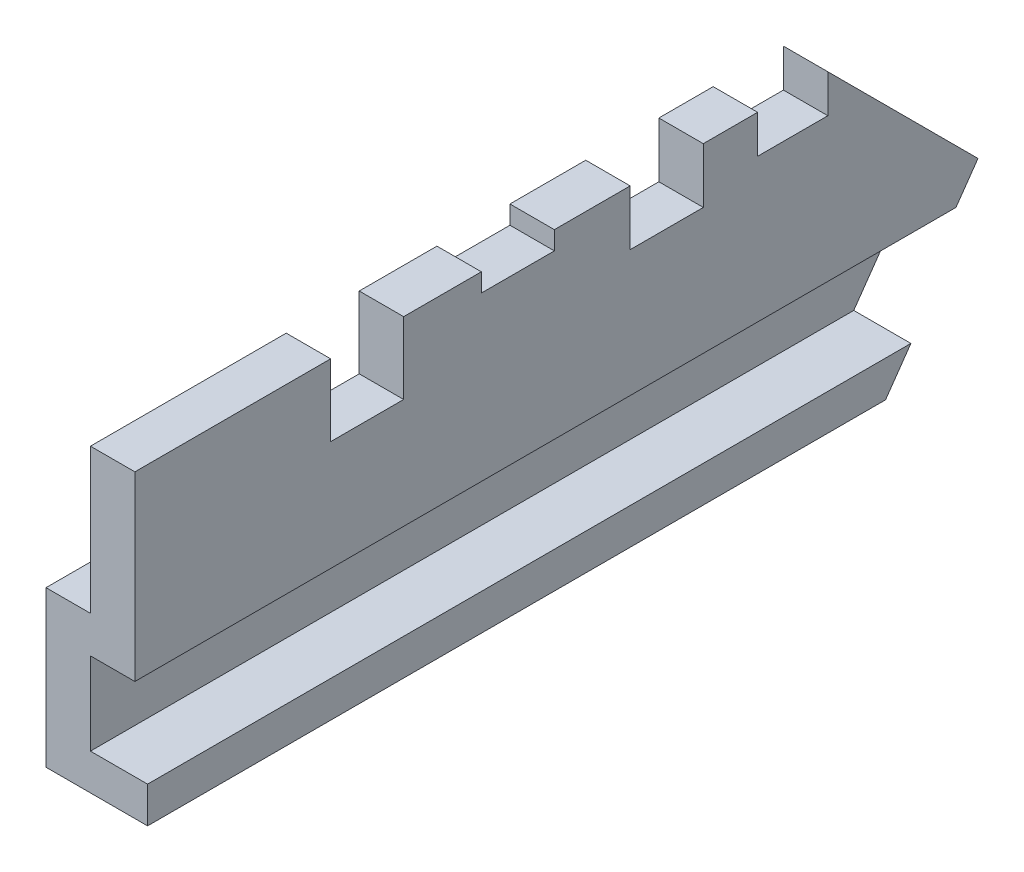
ISO-10303-21;
HEADER;
FILE_DESCRIPTION(('STEP AP214'),'2;1');
FILE_NAME('part.step','',(''),(''),'','','');
FILE_SCHEMA(('AUTOMOTIVE_DESIGN { 1 0 10303 214 1 1 1 1 }'));
ENDSEC;
DATA;
#1=APPLICATION_CONTEXT('core data for automotive mechanical design processes');
#2=APPLICATION_PROTOCOL_DEFINITION('international standard','automotive_design',2000,#1);
#3=PRODUCT_CONTEXT('',#1,'mechanical');
#4=PRODUCT('Part','Part','',(#3));
#5=PRODUCT_RELATED_PRODUCT_CATEGORY('part','',(#4));
#6=PRODUCT_DEFINITION_FORMATION('','',#4);
#7=PRODUCT_DEFINITION_CONTEXT('part definition',#1,'design');
#8=PRODUCT_DEFINITION('design','',#6,#7);
#9=PRODUCT_DEFINITION_SHAPE('','',#8);
#10=(LENGTH_UNIT() NAMED_UNIT(*) SI_UNIT(.MILLI.,.METRE.));
#11=(NAMED_UNIT(*) PLANE_ANGLE_UNIT() SI_UNIT($,.RADIAN.));
#12=(NAMED_UNIT(*) SI_UNIT($,.STERADIAN.) SOLID_ANGLE_UNIT());
#13=UNCERTAINTY_MEASURE_WITH_UNIT(LENGTH_MEASURE(1.E-05),#10,'distance_accuracy_value','');
#14=(GEOMETRIC_REPRESENTATION_CONTEXT(3) GLOBAL_UNCERTAINTY_ASSIGNED_CONTEXT((#13)) GLOBAL_UNIT_ASSIGNED_CONTEXT((#10,
#11,#12)) REPRESENTATION_CONTEXT('',''));
#15=CARTESIAN_POINT('',(0.,0.,0.));
#16=DIRECTION('',(0.,0.,1.));
#17=DIRECTION('',(1.,0.,0.));
#18=AXIS2_PLACEMENT_3D('',#15,#16,#17);
#19=CARTESIAN_POINT('',(0.,2.28,13.28));
#20=DIRECTION('',(0.,-1.,0.));
#21=DIRECTION('',(1.,0.,0.));
#22=AXIS2_PLACEMENT_3D('',#19,#20,#21);
#23=PLANE('',#22);
#24=DIRECTION('',(1.,0.,0.));
#25=VECTOR('',#24,1.);
#26=CARTESIAN_POINT('',(0.,2.28,3.47118438133992));
#27=LINE('',#26,#25);
#28=CARTESIAN_POINT('',(0.,2.28,3.47118438133992));
#29=VERTEX_POINT('',#28);
#30=CARTESIAN_POINT('',(0.7,2.28,3.47118438133992));
#31=VERTEX_POINT('',#30);
#32=EDGE_CURVE('E214',#29,#31,#27,.T.);
#33=ORIENTED_EDGE('',*,*,#32,.F.);
#34=DIRECTION('',(0.,0.,-1.));
#35=VECTOR('',#34,1.);
#36=CARTESIAN_POINT('',(0.,2.28,13.28));
#37=LINE('',#36,#35);
#38=CARTESIAN_POINT('',(0.,2.28,4.3267865277607));
#39=VERTEX_POINT('',#38);
#40=EDGE_CURVE('E251',#39,#29,#37,.T.);
#41=ORIENTED_EDGE('',*,*,#40,.F.);
#42=DIRECTION('',(1.,0.,0.));
#43=VECTOR('',#42,1.);
#44=CARTESIAN_POINT('',(0.,2.28,4.32678652776069));
#45=LINE('',#44,#43);
#46=CARTESIAN_POINT('',(0.7,2.28,4.32678652776069));
#47=VERTEX_POINT('',#46);
#48=EDGE_CURVE('E54',#39,#47,#45,.T.);
#49=ORIENTED_EDGE('',*,*,#48,.T.);
#50=DIRECTION('',(0.,0.,-1.));
#51=VECTOR('',#50,1.);
#52=CARTESIAN_POINT('',(0.7,2.28,13.28));
#53=LINE('',#52,#51);
#54=EDGE_CURVE('E234',#47,#31,#53,.T.);
#55=ORIENTED_EDGE('',*,*,#54,.T.);
#56=EDGE_LOOP('',(#33,#41,#49,#55));
#57=FACE_BOUND('',#56,.T.);
#58=ADVANCED_FACE('F37',(#57),#23,.F.);
#59=DIRECTION('',(1.,0.,0.));
#60=VECTOR('',#59,1.);
#61=CARTESIAN_POINT('',(0.,2.28,5.47861114558183));
#62=LINE('',#61,#60);
#63=CARTESIAN_POINT('',(0.,2.28,5.47861114558183));
#64=VERTEX_POINT('',#63);
#65=CARTESIAN_POINT('',(0.7,2.28,5.47861114558183));
#66=VERTEX_POINT('',#65);
#67=EDGE_CURVE('E587',#64,#66,#62,.T.);
#68=ORIENTED_EDGE('',*,*,#67,.F.);
#69=CARTESIAN_POINT('',(0.,2.28,6.67250000000002));
#70=VERTEX_POINT('',#69);
#71=EDGE_CURVE('E269',#70,#64,#37,.T.);
#72=ORIENTED_EDGE('',*,*,#71,.F.);
#73=DIRECTION('',(-1.,0.,0.));
#74=VECTOR('',#73,1.);
#75=CARTESIAN_POINT('',(0.7,2.28,6.67250000000001));
#76=LINE('',#75,#74);
#77=CARTESIAN_POINT('',(0.7,2.28,6.67250000000001));
#78=VERTEX_POINT('',#77);
#79=EDGE_CURVE('E365',#78,#70,#76,.T.);
#80=ORIENTED_EDGE('',*,*,#79,.F.);
#81=EDGE_CURVE('E239',#78,#66,#53,.T.);
#82=ORIENTED_EDGE('',*,*,#81,.T.);
#83=EDGE_LOOP('',(#68,#72,#80,#82));
#84=FACE_BOUND('',#83,.T.);
#85=ADVANCED_FACE('F504',(#84),#23,.F.);
#86=CARTESIAN_POINT('',(0.7,2.28,13.28));
#87=DIRECTION('',(-1.,0.,0.));
#88=DIRECTION('',(0.,-1.,0.));
#89=AXIS2_PLACEMENT_3D('',#86,#87,#88);
#90=PLANE('',#89);
#91=DIRECTION('',(0.,0.707106781186544,0.707106781186551));
#92=VECTOR('',#91,1.);
#93=CARTESIAN_POINT('',(0.699999999999999,7.73749999999999,7.82250000000007));
#94=LINE('',#93,#92);
#95=CARTESIAN_POINT('',(0.7,-0.084999999999997,0.));
#96=VERTEX_POINT('',#95);
#97=CARTESIAN_POINT('',(0.7,2.28,2.36500000000003));
#98=VERTEX_POINT('',#97);
#99=EDGE_CURVE('E415',#96,#98,#94,.T.);
#100=ORIENTED_EDGE('',*,*,#99,.T.);
#101=DIRECTION('',(0.,-1.,0.));
#102=VECTOR('',#101,1.);
#103=CARTESIAN_POINT('',(0.7,2.28,2.36500000000003));
#104=LINE('',#103,#102);
#105=CARTESIAN_POINT('',(0.7,1.68,2.36500000000003));
#106=VERTEX_POINT('',#105);
#107=EDGE_CURVE('E464',#98,#106,#104,.T.);
#108=ORIENTED_EDGE('',*,*,#107,.T.);
#109=DIRECTION('',(0.,0.,-1.));
#110=VECTOR('',#109,1.);
#111=CARTESIAN_POINT('',(0.7,1.68,3.47118438133992));
#112=LINE('',#111,#110);
#113=CARTESIAN_POINT('',(0.7,1.68,3.47118438133992));
#114=VERTEX_POINT('',#113);
#115=EDGE_CURVE('E237',#114,#106,#112,.T.);
#116=ORIENTED_EDGE('',*,*,#115,.F.);
#117=DIRECTION('',(0.,-1.,0.));
#118=VECTOR('',#117,1.);
#119=CARTESIAN_POINT('',(0.7,2.28,3.47118438133992));
#120=LINE('',#119,#118);
#121=EDGE_CURVE('E217',#31,#114,#120,.T.);
#122=ORIENTED_EDGE('',*,*,#121,.F.);
#123=ORIENTED_EDGE('',*,*,#54,.F.);
#124=DIRECTION('',(0.,-1.,0.));
#125=VECTOR('',#124,1.);
#126=CARTESIAN_POINT('',(0.7,2.28,4.32678652776069));
#127=LINE('',#126,#125);
#128=CARTESIAN_POINT('',(0.7,1.41,4.32678652776069));
#129=VERTEX_POINT('',#128);
#130=EDGE_CURVE('E610',#47,#129,#127,.T.);
#131=ORIENTED_EDGE('',*,*,#130,.T.);
#132=DIRECTION('',(0.,0.,-1.));
#133=VECTOR('',#132,1.);
#134=CARTESIAN_POINT('',(0.699999999999999,1.41,5.47861114558183));
#135=LINE('',#134,#133);
#136=CARTESIAN_POINT('',(0.7,1.41,5.47861114558183));
#137=VERTEX_POINT('',#136);
#138=EDGE_CURVE('E614',#137,#129,#135,.T.);
#139=ORIENTED_EDGE('',*,*,#138,.F.);
#140=DIRECTION('',(0.,-1.,0.));
#141=VECTOR('',#140,1.);
#142=CARTESIAN_POINT('',(0.7,2.28,5.47861114558183));
#143=LINE('',#142,#141);
#144=EDGE_CURVE('E591',#66,#137,#143,.T.);
#145=ORIENTED_EDGE('',*,*,#144,.F.);
#146=ORIENTED_EDGE('',*,*,#81,.F.);
#147=DIRECTION('',(0.,-1.,0.));
#148=VECTOR('',#147,1.);
#149=CARTESIAN_POINT('',(0.7,2.28,6.67250000000001));
#150=LINE('',#149,#148);
#151=CARTESIAN_POINT('',(0.7,1.99,6.67250000000001));
#152=VERTEX_POINT('',#151);
#153=EDGE_CURVE('E368',#78,#152,#150,.T.);
#154=ORIENTED_EDGE('',*,*,#153,.T.);
#155=DIRECTION('',(0.,0.,-1.));
#156=VECTOR('',#155,1.);
#157=CARTESIAN_POINT('',(0.7,1.99,7.82250000000001));
#158=LINE('',#157,#156);
#159=CARTESIAN_POINT('',(0.7,1.99,7.82250000000001));
#160=VERTEX_POINT('',#159);
#161=EDGE_CURVE('E367',#160,#152,#158,.T.);
#162=ORIENTED_EDGE('',*,*,#161,.F.);
#163=DIRECTION('',(0.,-1.,0.));
#164=VECTOR('',#163,1.);
#165=CARTESIAN_POINT('',(0.7,2.28,7.82250000000001));
#166=LINE('',#165,#164);
#167=CARTESIAN_POINT('',(0.7,2.28,7.82250000000001));
#168=VERTEX_POINT('',#167);
#169=EDGE_CURVE('E354',#168,#160,#166,.T.);
#170=ORIENTED_EDGE('',*,*,#169,.F.);
#171=CARTESIAN_POINT('',(0.7,2.28,9.04639744515782));
#172=VERTEX_POINT('',#171);
#173=EDGE_CURVE('E243',#172,#168,#53,.T.);
#174=ORIENTED_EDGE('',*,*,#173,.F.);
#175=DIRECTION('',(0.,-1.,0.));
#176=VECTOR('',#175,1.);
#177=CARTESIAN_POINT('',(0.7,2.28,9.04639744515782));
#178=LINE('',#177,#176);
#179=CARTESIAN_POINT('',(0.699999999999999,1.15,9.04639744515782));
#180=VERTEX_POINT('',#179);
#181=EDGE_CURVE('E321',#172,#180,#178,.T.);
#182=ORIENTED_EDGE('',*,*,#181,.T.);
#183=DIRECTION('',(0.,0.,-1.));
#184=VECTOR('',#183,1.);
#185=CARTESIAN_POINT('',(0.699999999999999,1.15,10.1963974451578));
#186=LINE('',#185,#184);
#187=CARTESIAN_POINT('',(0.699999999999999,1.15,10.1963974451578));
#188=VERTEX_POINT('',#187);
#189=EDGE_CURVE('E316',#188,#180,#186,.T.);
#190=ORIENTED_EDGE('',*,*,#189,.F.);
#191=DIRECTION('',(0.,-1.,0.));
#192=VECTOR('',#191,1.);
#193=CARTESIAN_POINT('',(0.7,2.28,10.1963974451578));
#194=LINE('',#193,#192);
#195=CARTESIAN_POINT('',(0.7,2.28,10.1963974451578));
#196=VERTEX_POINT('',#195);
#197=EDGE_CURVE('E313',#196,#188,#194,.T.);
#198=ORIENTED_EDGE('',*,*,#197,.F.);
#199=CARTESIAN_POINT('',(0.7,2.28,13.28));
#200=VERTEX_POINT('',#199);
#201=EDGE_CURVE('E267',#200,#196,#53,.T.);
#202=ORIENTED_EDGE('',*,*,#201,.F.);
#203=DIRECTION('',(0.,1.,0.));
#204=VECTOR('',#203,1.);
#205=CARTESIAN_POINT('',(0.7,2.28,13.28));
#206=LINE('',#205,#204);
#207=CARTESIAN_POINT('',(0.7,-0.58,13.28));
#208=VERTEX_POINT('',#207);
#209=EDGE_CURVE('E311',#208,#200,#206,.T.);
#210=ORIENTED_EDGE('',*,*,#209,.F.);
#211=DIRECTION('',(0.,0.,-1.));
#212=VECTOR('',#211,1.);
#213=CARTESIAN_POINT('',(0.7,-0.58,13.28));
#214=LINE('',#213,#212);
#215=CARTESIAN_POINT('',(0.7,-0.58,0.346602731413814));
#216=VERTEX_POINT('',#215);
#217=EDGE_CURVE('E260',#208,#216,#214,.T.);
#218=ORIENTED_EDGE('',*,*,#217,.T.);
#219=DIRECTION('',(0.,0.81915204428899,-0.573576436351048));
#220=VECTOR('',#219,1.);
#221=CARTESIAN_POINT('',(0.700000000000001,-4.73762018253584,3.25779972423826));
#222=LINE('',#221,#220);
#223=EDGE_CURVE('E414',#216,#96,#222,.T.);
#224=ORIENTED_EDGE('',*,*,#223,.T.);
#225=EDGE_LOOP('',(#100,#108,#116,#122,#123,#131,#139,#145,#146,#154,#162,#170,#174,#182,#190,
#198,#202,#210,#218,#224));
#226=FACE_BOUND('',#225,.T.);
#227=ADVANCED_FACE('F232',(#226),#90,.F.);
#228=CARTESIAN_POINT('',(0.,0.,13.28));
#229=DIRECTION('',(1.,0.,0.));
#230=DIRECTION('',(0.,1.,0.));
#231=AXIS2_PLACEMENT_3D('',#228,#229,#230);
#232=PLANE('',#231);
#233=DIRECTION('',(0.,0.,-1.));
#234=VECTOR('',#233,1.);
#235=CARTESIAN_POINT('',(0.,1.68,3.47118438133992));
#236=LINE('',#235,#234);
#237=CARTESIAN_POINT('',(0.,1.68,3.47118438133992));
#238=VERTEX_POINT('',#237);
#239=CARTESIAN_POINT('',(0.,1.68,2.36500000000003));
#240=VERTEX_POINT('',#239);
#241=EDGE_CURVE('E632',#238,#240,#236,.T.);
#242=ORIENTED_EDGE('',*,*,#241,.T.);
#243=DIRECTION('',(0.,-1.,0.));
#244=VECTOR('',#243,1.);
#245=CARTESIAN_POINT('',(0.,2.28,2.36500000000003));
#246=LINE('',#245,#244);
#247=CARTESIAN_POINT('',(0.,2.28,2.36500000000003));
#248=VERTEX_POINT('',#247);
#249=EDGE_CURVE('E457',#248,#240,#246,.T.);
#250=ORIENTED_EDGE('',*,*,#249,.F.);
#251=DIRECTION('',(0.,-0.707106781186544,-0.707106781186551));
#252=VECTOR('',#251,1.);
#253=CARTESIAN_POINT('',(0.,6.5975,6.68250000000007));
#254=LINE('',#253,#252);
#255=CARTESIAN_POINT('',(0.,0.,0.0850000000000009));
#256=VERTEX_POINT('',#255);
#257=EDGE_CURVE('E410',#248,#256,#254,.T.);
#258=ORIENTED_EDGE('',*,*,#257,.T.);
#259=DIRECTION('',(0.,0.,-1.));
#260=VECTOR('',#259,1.);
#261=CARTESIAN_POINT('',(0.,0.,13.28));
#262=LINE('',#261,#260);
#263=CARTESIAN_POINT('',(0.,0.,13.28));
#264=VERTEX_POINT('',#263);
#265=EDGE_CURVE('E279',#264,#256,#262,.T.);
#266=ORIENTED_EDGE('',*,*,#265,.F.);
#267=DIRECTION('',(0.,-1.,0.));
#268=VECTOR('',#267,1.);
#269=CARTESIAN_POINT('',(0.,0.,13.28));
#270=LINE('',#269,#268);
#271=CARTESIAN_POINT('',(0.,2.28,13.28));
#272=VERTEX_POINT('',#271);
#273=EDGE_CURVE('E445',#272,#264,#270,.T.);
#274=ORIENTED_EDGE('',*,*,#273,.F.);
#275=CARTESIAN_POINT('',(0.,2.28,10.1963974451578));
#276=VERTEX_POINT('',#275);
#277=EDGE_CURVE('E240',#272,#276,#37,.T.);
#278=ORIENTED_EDGE('',*,*,#277,.T.);
#279=DIRECTION('',(0.,-1.,0.));
#280=VECTOR('',#279,1.);
#281=CARTESIAN_POINT('',(0.,2.28,10.1963974451578));
#282=LINE('',#281,#280);
#283=CARTESIAN_POINT('',(0.,1.15,10.1963974451578));
#284=VERTEX_POINT('',#283);
#285=EDGE_CURVE('E332',#276,#284,#282,.T.);
#286=ORIENTED_EDGE('',*,*,#285,.T.);
#287=DIRECTION('',(0.,0.,-1.));
#288=VECTOR('',#287,1.);
#289=CARTESIAN_POINT('',(0.,1.15,10.1963974451578));
#290=LINE('',#289,#288);
#291=CARTESIAN_POINT('',(0.,1.15,9.04639744515782));
#292=VERTEX_POINT('',#291);
#293=EDGE_CURVE('E62',#284,#292,#290,.T.);
#294=ORIENTED_EDGE('',*,*,#293,.T.);
#295=DIRECTION('',(0.,-1.,0.));
#296=VECTOR('',#295,1.);
#297=CARTESIAN_POINT('',(0.,2.28,9.04639744515782));
#298=LINE('',#297,#296);
#299=CARTESIAN_POINT('',(0.,2.28,9.04639744515782));
#300=VERTEX_POINT('',#299);
#301=EDGE_CURVE('E348',#300,#292,#298,.T.);
#302=ORIENTED_EDGE('',*,*,#301,.F.);
#303=CARTESIAN_POINT('',(0.,2.28,7.82250000000001));
#304=VERTEX_POINT('',#303);
#305=EDGE_CURVE('E246',#300,#304,#37,.T.);
#306=ORIENTED_EDGE('',*,*,#305,.T.);
#307=DIRECTION('',(0.,-1.,0.));
#308=VECTOR('',#307,1.);
#309=CARTESIAN_POINT('',(0.,2.28,7.82250000000001));
#310=LINE('',#309,#308);
#311=CARTESIAN_POINT('',(0.,1.99,7.82250000000001));
#312=VERTEX_POINT('',#311);
#313=EDGE_CURVE('E362',#304,#312,#310,.T.);
#314=ORIENTED_EDGE('',*,*,#313,.T.);
#315=DIRECTION('',(0.,0.,-1.));
#316=VECTOR('',#315,1.);
#317=CARTESIAN_POINT('',(0.,1.99,7.82250000000001));
#318=LINE('',#317,#316);
#319=CARTESIAN_POINT('',(0.,1.99,6.67250000000001));
#320=VERTEX_POINT('',#319);
#321=EDGE_CURVE('E390',#312,#320,#318,.T.);
#322=ORIENTED_EDGE('',*,*,#321,.T.);
#323=DIRECTION('',(0.,-1.,0.));
#324=VECTOR('',#323,1.);
#325=CARTESIAN_POINT('',(0.,2.28,6.67250000000001));
#326=LINE('',#325,#324);
#327=EDGE_CURVE('E386',#70,#320,#326,.T.);
#328=ORIENTED_EDGE('',*,*,#327,.F.);
#329=ORIENTED_EDGE('',*,*,#71,.T.);
#330=DIRECTION('',(0.,-1.,0.));
#331=VECTOR('',#330,1.);
#332=CARTESIAN_POINT('',(0.,2.28,5.47861114558183));
#333=LINE('',#332,#331);
#334=CARTESIAN_POINT('',(0.,1.41,5.47861114558183));
#335=VERTEX_POINT('',#334);
#336=EDGE_CURVE('E585',#64,#335,#333,.T.);
#337=ORIENTED_EDGE('',*,*,#336,.T.);
#338=DIRECTION('',(0.,0.,-1.));
#339=VECTOR('',#338,1.);
#340=CARTESIAN_POINT('',(0.,1.41,5.47861114558183));
#341=LINE('',#340,#339);
#342=CARTESIAN_POINT('',(0.,1.41,4.32678652776069));
#343=VERTEX_POINT('',#342);
#344=EDGE_CURVE('E333',#335,#343,#341,.T.);
#345=ORIENTED_EDGE('',*,*,#344,.T.);
#346=DIRECTION('',(0.,-1.,0.));
#347=VECTOR('',#346,1.);
#348=CARTESIAN_POINT('',(0.,2.28,4.32678652776069));
#349=LINE('',#348,#347);
#350=EDGE_CURVE('E595',#39,#343,#349,.T.);
#351=ORIENTED_EDGE('',*,*,#350,.F.);
#352=ORIENTED_EDGE('',*,*,#40,.T.);
#353=DIRECTION('',(0.,-1.,0.));
#354=VECTOR('',#353,1.);
#355=CARTESIAN_POINT('',(0.,2.28,3.47118438133992));
#356=LINE('',#355,#354);
#357=EDGE_CURVE('E220',#29,#238,#356,.T.);
#358=ORIENTED_EDGE('',*,*,#357,.T.);
#359=EDGE_LOOP('',(#242,#250,#258,#266,#274,#278,#286,#294,#302,#306,#314,#322,#328,#329,#337,
#345,#351,#352,#358));
#360=FACE_BOUND('',#359,.T.);
#361=ADVANCED_FACE('F454',(#360),#232,.F.);
#362=DIRECTION('',(1.,0.,0.));
#363=VECTOR('',#362,1.);
#364=CARTESIAN_POINT('',(0.,2.28,10.1963974451578));
#365=LINE('',#364,#363);
#366=EDGE_CURVE('E308',#276,#196,#365,.T.);
#367=ORIENTED_EDGE('',*,*,#366,.F.);
#368=ORIENTED_EDGE('',*,*,#277,.F.);
#369=DIRECTION('',(-1.,0.,0.));
#370=VECTOR('',#369,1.);
#371=CARTESIAN_POINT('',(0.,2.28,13.28));
#372=LINE('',#371,#370);
#373=EDGE_CURVE('E309',#200,#272,#372,.T.);
#374=ORIENTED_EDGE('',*,*,#373,.F.);
#375=ORIENTED_EDGE('',*,*,#201,.T.);
#376=EDGE_LOOP('',(#367,#368,#374,#375));
#377=FACE_BOUND('',#376,.T.);
#378=ADVANCED_FACE('F306',(#377),#23,.F.);
#379=CARTESIAN_POINT('',(-0.7,0.,13.28));
#380=DIRECTION('',(0.,-1.,0.));
#381=DIRECTION('',(0.,0.,-1.));
#382=AXIS2_PLACEMENT_3D('',#379,#380,#381);
#383=PLANE('',#382);
#384=ORIENTED_EDGE('',*,*,#265,.T.);
#385=DIRECTION('',(-1.,0.,0.));
#386=VECTOR('',#385,1.);
#387=CARTESIAN_POINT('',(-0.7,0.,0.085));
#388=LINE('',#387,#386);
#389=CARTESIAN_POINT('',(-0.7,0.,0.0850000000000016));
#390=VERTEX_POINT('',#389);
#391=EDGE_CURVE('E411',#256,#390,#388,.T.);
#392=ORIENTED_EDGE('',*,*,#391,.T.);
#393=DIRECTION('',(0.,0.,-1.));
#394=VECTOR('',#393,1.);
#395=CARTESIAN_POINT('',(-0.7,0.,13.28));
#396=LINE('',#395,#394);
#397=CARTESIAN_POINT('',(-0.7,0.,13.28));
#398=VERTEX_POINT('',#397);
#399=EDGE_CURVE('E12',#398,#390,#396,.T.);
#400=ORIENTED_EDGE('',*,*,#399,.F.);
#401=DIRECTION('',(-1.,0.,0.));
#402=VECTOR('',#401,1.);
#403=CARTESIAN_POINT('',(-0.7,0.,13.28));
#404=LINE('',#403,#402);
#405=EDGE_CURVE('E428',#264,#398,#404,.T.);
#406=ORIENTED_EDGE('',*,*,#405,.F.);
#407=EDGE_LOOP('',(#384,#392,#400,#406));
#408=FACE_BOUND('',#407,.T.);
#409=ADVANCED_FACE('F39',(#408),#383,.F.);
#410=CARTESIAN_POINT('',(-0.7,-2.45,13.28));
#411=DIRECTION('',(1.,0.,0.));
#412=DIRECTION('',(0.,0.,-1.));
#413=AXIS2_PLACEMENT_3D('',#410,#411,#412);
#414=PLANE('',#413);
#415=DIRECTION('',(0.,-0.707106781186544,-0.707106781186551));
#416=VECTOR('',#415,1.);
#417=CARTESIAN_POINT('',(-0.7,-0.084999999999997,0.));
#418=LINE('',#417,#416);
#419=CARTESIAN_POINT('',(-0.7,-0.084999999999997,0.));
#420=VERTEX_POINT('',#419);
#421=EDGE_CURVE('E401',#390,#420,#418,.T.);
#422=ORIENTED_EDGE('',*,*,#421,.T.);
#423=DIRECTION('',(0.,-0.81915204428899,0.573576436351048));
#424=VECTOR('',#423,1.);
#425=CARTESIAN_POINT('',(-0.7,-0.084999999999997,0.));
#426=LINE('',#425,#424);
#427=CARTESIAN_POINT('',(-0.7,-2.45,1.65599082786598));
#428=VERTEX_POINT('',#427);
#429=EDGE_CURVE('E404',#420,#428,#426,.T.);
#430=ORIENTED_EDGE('',*,*,#429,.T.);
#431=DIRECTION('',(0.,0.,-1.));
#432=VECTOR('',#431,1.);
#433=CARTESIAN_POINT('',(-0.7,-2.45,13.28));
#434=LINE('',#433,#432);
#435=CARTESIAN_POINT('',(-0.7,-2.45,13.28));
#436=VERTEX_POINT('',#435);
#437=EDGE_CURVE('E46',#436,#428,#434,.T.);
#438=ORIENTED_EDGE('',*,*,#437,.F.);
#439=DIRECTION('',(0.,-1.,0.));
#440=VECTOR('',#439,1.);
#441=CARTESIAN_POINT('',(-0.7,-2.45,13.28));
#442=LINE('',#441,#440);
#443=EDGE_CURVE('E431',#398,#436,#442,.T.);
#444=ORIENTED_EDGE('',*,*,#443,.F.);
#445=ORIENTED_EDGE('',*,*,#399,.T.);
#446=EDGE_LOOP('',(#422,#430,#438,#444,#445));
#447=FACE_BOUND('',#446,.T.);
#448=ADVANCED_FACE('F471',(#447),#414,.F.);
#449=CARTESIAN_POINT('',(0.9,-2.45,13.28));
#450=DIRECTION('',(0.,1.,0.));
#451=DIRECTION('',(0.,0.,1.));
#452=AXIS2_PLACEMENT_3D('',#449,#450,#451);
#453=PLANE('',#452);
#454=ORIENTED_EDGE('',*,*,#437,.T.);
#455=DIRECTION('',(1.,0.,0.));
#456=VECTOR('',#455,1.);
#457=CARTESIAN_POINT('',(0.9,-2.45,1.65599082786598));
#458=LINE('',#457,#456);
#459=CARTESIAN_POINT('',(0.9,-2.45,1.65599082786598));
#460=VERTEX_POINT('',#459);
#461=EDGE_CURVE('E425',#428,#460,#458,.T.);
#462=ORIENTED_EDGE('',*,*,#461,.T.);
#463=DIRECTION('',(0.,0.,-1.));
#464=VECTOR('',#463,1.);
#465=CARTESIAN_POINT('',(0.9,-2.45,13.28));
#466=LINE('',#465,#464);
#467=CARTESIAN_POINT('',(0.9,-2.45,13.28));
#468=VERTEX_POINT('',#467);
#469=EDGE_CURVE('E283',#468,#460,#466,.T.);
#470=ORIENTED_EDGE('',*,*,#469,.F.);
#471=DIRECTION('',(1.,0.,0.));
#472=VECTOR('',#471,1.);
#473=CARTESIAN_POINT('',(0.9,-2.45,13.28));
#474=LINE('',#473,#472);
#475=EDGE_CURVE('E433',#436,#468,#474,.T.);
#476=ORIENTED_EDGE('',*,*,#475,.F.);
#477=EDGE_LOOP('',(#454,#462,#470,#476));
#478=FACE_BOUND('',#477,.T.);
#479=ADVANCED_FACE('F772',(#478),#453,.F.);
#480=CARTESIAN_POINT('',(0.9,-1.88,13.28));
#481=DIRECTION('',(-1.,0.,0.));
#482=DIRECTION('',(0.,-1.,0.));
#483=AXIS2_PLACEMENT_3D('',#480,#481,#482);
#484=PLANE('',#483);
#485=ORIENTED_EDGE('',*,*,#469,.T.);
#486=DIRECTION('',(0.,-0.81915204428899,0.573576436351048));
#487=VECTOR('',#486,1.);
#488=CARTESIAN_POINT('',(0.9,-0.084999999999997,0.));
#489=LINE('',#488,#487);
#490=CARTESIAN_POINT('',(0.9,-1.88,1.25687253108644));
#491=VERTEX_POINT('',#490);
#492=EDGE_CURVE('E378',#491,#460,#489,.T.);
#493=ORIENTED_EDGE('',*,*,#492,.F.);
#494=DIRECTION('',(0.,0.,-1.));
#495=VECTOR('',#494,1.);
#496=CARTESIAN_POINT('',(0.9,-1.88,13.28));
#497=LINE('',#496,#495);
#498=CARTESIAN_POINT('',(0.9,-1.88,13.28));
#499=VERTEX_POINT('',#498);
#500=EDGE_CURVE('E286',#499,#491,#497,.T.);
#501=ORIENTED_EDGE('',*,*,#500,.F.);
#502=DIRECTION('',(0.,1.,0.));
#503=VECTOR('',#502,1.);
#504=CARTESIAN_POINT('',(0.9,-1.88,13.28));
#505=LINE('',#504,#503);
#506=EDGE_CURVE('E435',#468,#499,#505,.T.);
#507=ORIENTED_EDGE('',*,*,#506,.F.);
#508=EDGE_LOOP('',(#485,#493,#501,#507));
#509=FACE_BOUND('',#508,.T.);
#510=ADVANCED_FACE('F763',(#509),#484,.F.);
#511=CARTESIAN_POINT('',(0.9,-1.88,13.28));
#512=DIRECTION('',(0.,-1.,0.));
#513=DIRECTION('',(0.,0.,-1.));
#514=AXIS2_PLACEMENT_3D('',#511,#512,#513);
#515=PLANE('',#514);
#516=ORIENTED_EDGE('',*,*,#500,.T.);
#517=DIRECTION('',(-1.,0.,0.));
#518=VECTOR('',#517,1.);
#519=CARTESIAN_POINT('',(0.9,-1.88,1.25687253108644));
#520=LINE('',#519,#518);
#521=CARTESIAN_POINT('',(0.,-1.88,1.25687253108644));
#522=VERTEX_POINT('',#521);
#523=EDGE_CURVE('E422',#491,#522,#520,.T.);
#524=ORIENTED_EDGE('',*,*,#523,.T.);
#525=DIRECTION('',(0.,0.,-1.));
#526=VECTOR('',#525,1.);
#527=CARTESIAN_POINT('',(0.,-1.88,13.28));
#528=LINE('',#527,#526);
#529=CARTESIAN_POINT('',(0.,-1.88,13.28));
#530=VERTEX_POINT('',#529);
#531=EDGE_CURVE('E289',#530,#522,#528,.T.);
#532=ORIENTED_EDGE('',*,*,#531,.F.);
#533=DIRECTION('',(-1.,0.,0.));
#534=VECTOR('',#533,1.);
#535=CARTESIAN_POINT('',(0.9,-1.88,13.28));
#536=LINE('',#535,#534);
#537=EDGE_CURVE('E437',#499,#530,#536,.T.);
#538=ORIENTED_EDGE('',*,*,#537,.F.);
#539=EDGE_LOOP('',(#516,#524,#532,#538));
#540=FACE_BOUND('',#539,.T.);
#541=ADVANCED_FACE('F754',(#540),#515,.F.);
#542=CARTESIAN_POINT('',(0.,-0.58,13.28));
#543=DIRECTION('',(-1.,0.,0.));
#544=DIRECTION('',(0.,-1.,0.));
#545=AXIS2_PLACEMENT_3D('',#542,#543,#544);
#546=PLANE('',#545);
#547=ORIENTED_EDGE('',*,*,#531,.T.);
#548=DIRECTION('',(0.,0.81915204428899,-0.573576436351048));
#549=VECTOR('',#548,1.);
#550=CARTESIAN_POINT('',(0.,-6.65670898749154,4.60156017196211));
#551=LINE('',#550,#549);
#552=CARTESIAN_POINT('',(0.,-0.58,0.346602731413815));
#553=VERTEX_POINT('',#552);
#554=EDGE_CURVE('E419',#522,#553,#551,.T.);
#555=ORIENTED_EDGE('',*,*,#554,.T.);
#556=DIRECTION('',(0.,0.,-1.));
#557=VECTOR('',#556,1.);
#558=CARTESIAN_POINT('',(0.,-0.58,13.28));
#559=LINE('',#558,#557);
#560=CARTESIAN_POINT('',(0.,-0.58,13.28));
#561=VERTEX_POINT('',#560);
#562=EDGE_CURVE('E291',#561,#553,#559,.T.);
#563=ORIENTED_EDGE('',*,*,#562,.F.);
#564=DIRECTION('',(0.,1.,0.));
#565=VECTOR('',#564,1.);
#566=CARTESIAN_POINT('',(0.,-0.58,13.28));
#567=LINE('',#566,#565);
#568=EDGE_CURVE('E439',#530,#561,#567,.T.);
#569=ORIENTED_EDGE('',*,*,#568,.F.);
#570=EDGE_LOOP('',(#547,#555,#563,#569));
#571=FACE_BOUND('',#570,.T.);
#572=ADVANCED_FACE('F521',(#571),#546,.F.);
#573=CARTESIAN_POINT('',(0.7,-0.58,13.28));
#574=DIRECTION('',(0.,1.,0.));
#575=DIRECTION('',(-1.,0.,0.));
#576=AXIS2_PLACEMENT_3D('',#573,#574,#575);
#577=PLANE('',#576);
#578=ORIENTED_EDGE('',*,*,#562,.T.);
#579=DIRECTION('',(1.,0.,0.));
#580=VECTOR('',#579,1.);
#581=CARTESIAN_POINT('',(0.699999999999999,-0.58,0.346602731413815));
#582=LINE('',#581,#580);
#583=EDGE_CURVE('E417',#553,#216,#582,.T.);
#584=ORIENTED_EDGE('',*,*,#583,.T.);
#585=ORIENTED_EDGE('',*,*,#217,.F.);
#586=DIRECTION('',(1.,0.,0.));
#587=VECTOR('',#586,1.);
#588=CARTESIAN_POINT('',(0.7,-0.58,13.28));
#589=LINE('',#588,#587);
#590=EDGE_CURVE('E441',#561,#208,#589,.T.);
#591=ORIENTED_EDGE('',*,*,#590,.F.);
#592=EDGE_LOOP('',(#578,#584,#585,#591));
#593=FACE_BOUND('',#592,.T.);
#594=ADVANCED_FACE('F514',(#593),#577,.F.);
#595=ORIENTED_EDGE('',*,*,#305,.F.);
#596=DIRECTION('',(1.,0.,0.));
#597=VECTOR('',#596,1.);
#598=CARTESIAN_POINT('',(0.,2.28,9.04639744515782));
#599=LINE('',#598,#597);
#600=EDGE_CURVE('E339',#300,#172,#599,.T.);
#601=ORIENTED_EDGE('',*,*,#600,.T.);
#602=ORIENTED_EDGE('',*,*,#173,.T.);
#603=DIRECTION('',(-1.,0.,0.));
#604=VECTOR('',#603,1.);
#605=CARTESIAN_POINT('',(0.7,2.28,7.82250000000001));
#606=LINE('',#605,#604);
#607=EDGE_CURVE('E356',#168,#304,#606,.T.);
#608=ORIENTED_EDGE('',*,*,#607,.T.);
#609=EDGE_LOOP('',(#595,#601,#602,#608));
#610=FACE_BOUND('',#609,.T.);
#611=ADVANCED_FACE('F506',(#610),#23,.F.);
#612=CARTESIAN_POINT('',(0.,0.,13.28));
#613=DIRECTION('',(0.,0.,1.));
#614=DIRECTION('',(1.,0.,0.));
#615=AXIS2_PLACEMENT_3D('',#612,#613,#614);
#616=PLANE('',#615);
#617=ORIENTED_EDGE('',*,*,#405,.T.);
#618=ORIENTED_EDGE('',*,*,#443,.T.);
#619=ORIENTED_EDGE('',*,*,#475,.T.);
#620=ORIENTED_EDGE('',*,*,#506,.T.);
#621=ORIENTED_EDGE('',*,*,#537,.T.);
#622=ORIENTED_EDGE('',*,*,#568,.T.);
#623=ORIENTED_EDGE('',*,*,#590,.T.);
#624=ORIENTED_EDGE('',*,*,#209,.T.);
#625=ORIENTED_EDGE('',*,*,#373,.T.);
#626=ORIENTED_EDGE('',*,*,#273,.T.);
#627=EDGE_LOOP('',(#617,#618,#619,#620,#621,#622,#623,#624,#625,#626));
#628=FACE_BOUND('',#627,.T.);
#629=ADVANCED_FACE('F474',(#628),#616,.T.);
#630=CARTESIAN_POINT('',(-0.7,-0.084999999999997,0.));
#631=DIRECTION('',(0.,0.573576436351048,0.81915204428899));
#632=DIRECTION('',(0.,-0.81915204428899,0.573576436351048));
#633=AXIS2_PLACEMENT_3D('',#630,#631,#632);
#634=PLANE('',#633);
#635=ORIENTED_EDGE('',*,*,#429,.F.);
#636=DIRECTION('',(1.,0.,0.));
#637=VECTOR('',#636,1.);
#638=CARTESIAN_POINT('',(-0.7,-0.084999999999997,0.));
#639=LINE('',#638,#637);
#640=EDGE_CURVE('E407',#420,#96,#639,.T.);
#641=ORIENTED_EDGE('',*,*,#640,.T.);
#642=ORIENTED_EDGE('',*,*,#223,.F.);
#643=ORIENTED_EDGE('',*,*,#583,.F.);
#644=ORIENTED_EDGE('',*,*,#554,.F.);
#645=ORIENTED_EDGE('',*,*,#523,.F.);
#646=ORIENTED_EDGE('',*,*,#492,.T.);
#647=ORIENTED_EDGE('',*,*,#461,.F.);
#648=EDGE_LOOP('',(#635,#641,#642,#643,#644,#645,#646,#647));
#649=FACE_BOUND('',#648,.T.);
#650=ADVANCED_FACE('F468',(#649),#634,.F.);
#651=CARTESIAN_POINT('',(-0.7,-0.084999999999997,0.));
#652=DIRECTION('',(0.,-0.707106781186551,0.707106781186544));
#653=DIRECTION('',(0.,-0.707106781186544,-0.707106781186551));
#654=AXIS2_PLACEMENT_3D('',#651,#652,#653);
#655=PLANE('',#654);
#656=ORIENTED_EDGE('',*,*,#257,.F.);
#657=DIRECTION('',(-1.,0.,0.));
#658=VECTOR('',#657,1.);
#659=CARTESIAN_POINT('',(0.,2.28,2.36500000000003));
#660=LINE('',#659,#658);
#661=EDGE_CURVE('E254',#98,#248,#660,.T.);
#662=ORIENTED_EDGE('',*,*,#661,.F.);
#663=ORIENTED_EDGE('',*,*,#99,.F.);
#664=ORIENTED_EDGE('',*,*,#640,.F.);
#665=ORIENTED_EDGE('',*,*,#421,.F.);
#666=ORIENTED_EDGE('',*,*,#391,.F.);
#667=EDGE_LOOP('',(#656,#662,#663,#664,#665,#666));
#668=FACE_BOUND('',#667,.T.);
#669=ADVANCED_FACE('F465',(#668),#655,.F.);
#670=CARTESIAN_POINT('',(0.,1.98999999999999,0.));
#671=DIRECTION('',(0.,-1.,0.));
#672=DIRECTION('',(1.,0.,0.));
#673=AXIS2_PLACEMENT_3D('',#670,#671,#672);
#674=PLANE('',#673);
#675=ORIENTED_EDGE('',*,*,#161,.T.);
#676=DIRECTION('',(-1.,0.,0.));
#677=VECTOR('',#676,1.);
#678=CARTESIAN_POINT('',(0.7,1.99,6.67250000000001));
#679=LINE('',#678,#677);
#680=EDGE_CURVE('E373',#152,#320,#679,.T.);
#681=ORIENTED_EDGE('',*,*,#680,.T.);
#682=ORIENTED_EDGE('',*,*,#321,.F.);
#683=DIRECTION('',(-1.,0.,0.));
#684=VECTOR('',#683,1.);
#685=CARTESIAN_POINT('',(0.7,1.99,7.82250000000001));
#686=LINE('',#685,#684);
#687=EDGE_CURVE('E357',#160,#312,#686,.T.);
#688=ORIENTED_EDGE('',*,*,#687,.F.);
#689=EDGE_LOOP('',(#675,#681,#682,#688));
#690=FACE_BOUND('',#689,.T.);
#691=ADVANCED_FACE('F487',(#690),#674,.F.);
#692=CARTESIAN_POINT('',(0.7,2.28,7.82250000000001));
#693=DIRECTION('',(0.,0.,1.));
#694=DIRECTION('',(1.,0.,0.));
#695=AXIS2_PLACEMENT_3D('',#692,#693,#694);
#696=PLANE('',#695);
#697=ORIENTED_EDGE('',*,*,#687,.T.);
#698=ORIENTED_EDGE('',*,*,#313,.F.);
#699=ORIENTED_EDGE('',*,*,#607,.F.);
#700=ORIENTED_EDGE('',*,*,#169,.T.);
#701=EDGE_LOOP('',(#697,#698,#699,#700));
#702=FACE_BOUND('',#701,.T.);
#703=ADVANCED_FACE('F500',(#702),#696,.F.);
#704=CARTESIAN_POINT('',(0.7,2.28,6.67250000000001));
#705=DIRECTION('',(0.,0.,1.));
#706=DIRECTION('',(1.,0.,0.));
#707=AXIS2_PLACEMENT_3D('',#704,#705,#706);
#708=PLANE('',#707);
#709=ORIENTED_EDGE('',*,*,#680,.F.);
#710=ORIENTED_EDGE('',*,*,#153,.F.);
#711=ORIENTED_EDGE('',*,*,#79,.T.);
#712=ORIENTED_EDGE('',*,*,#327,.T.);
#713=EDGE_LOOP('',(#709,#710,#711,#712));
#714=FACE_BOUND('',#713,.T.);
#715=ADVANCED_FACE('F534',(#714),#708,.T.);
#716=CARTESIAN_POINT('',(0.,1.15,0.));
#717=DIRECTION('',(0.,1.,0.));
#718=DIRECTION('',(0.,0.,1.));
#719=AXIS2_PLACEMENT_3D('',#716,#717,#718);
#720=PLANE('',#719);
#721=ORIENTED_EDGE('',*,*,#293,.F.);
#722=DIRECTION('',(1.,0.,0.));
#723=VECTOR('',#722,1.);
#724=CARTESIAN_POINT('',(0.,1.15,10.1963974451578));
#725=LINE('',#724,#723);
#726=EDGE_CURVE('E318',#284,#188,#725,.T.);
#727=ORIENTED_EDGE('',*,*,#726,.T.);
#728=ORIENTED_EDGE('',*,*,#189,.T.);
#729=DIRECTION('',(1.,0.,0.));
#730=VECTOR('',#729,1.);
#731=CARTESIAN_POINT('',(0.,1.15,9.04639744515782));
#732=LINE('',#731,#730);
#733=EDGE_CURVE('E344',#292,#180,#732,.T.);
#734=ORIENTED_EDGE('',*,*,#733,.F.);
#735=EDGE_LOOP('',(#721,#727,#728,#734));
#736=FACE_BOUND('',#735,.T.);
#737=ADVANCED_FACE('F495',(#736),#720,.T.);
#738=CARTESIAN_POINT('',(0.,2.28,9.04639744515782));
#739=DIRECTION('',(0.,0.,-1.));
#740=DIRECTION('',(-1.,0.,0.));
#741=AXIS2_PLACEMENT_3D('',#738,#739,#740);
#742=PLANE('',#741);
#743=ORIENTED_EDGE('',*,*,#733,.T.);
#744=ORIENTED_EDGE('',*,*,#181,.F.);
#745=ORIENTED_EDGE('',*,*,#600,.F.);
#746=ORIENTED_EDGE('',*,*,#301,.T.);
#747=EDGE_LOOP('',(#743,#744,#745,#746));
#748=FACE_BOUND('',#747,.T.);
#749=ADVANCED_FACE('F485',(#748),#742,.F.);
#750=CARTESIAN_POINT('',(0.,2.28,10.1963974451578));
#751=DIRECTION('',(0.,0.,-1.));
#752=DIRECTION('',(-1.,0.,0.));
#753=AXIS2_PLACEMENT_3D('',#750,#751,#752);
#754=PLANE('',#753);
#755=ORIENTED_EDGE('',*,*,#726,.F.);
#756=ORIENTED_EDGE('',*,*,#285,.F.);
#757=ORIENTED_EDGE('',*,*,#366,.T.);
#758=ORIENTED_EDGE('',*,*,#197,.T.);
#759=EDGE_LOOP('',(#755,#756,#757,#758));
#760=FACE_BOUND('',#759,.T.);
#761=ADVANCED_FACE('F482',(#760),#754,.T.);
#762=CARTESIAN_POINT('',(0.,1.41,0.));
#763=DIRECTION('',(0.,1.,0.));
#764=DIRECTION('',(0.,0.,1.));
#765=AXIS2_PLACEMENT_3D('',#762,#763,#764);
#766=PLANE('',#765);
#767=ORIENTED_EDGE('',*,*,#344,.F.);
#768=DIRECTION('',(1.,0.,0.));
#769=VECTOR('',#768,1.);
#770=CARTESIAN_POINT('',(0.,1.41,5.47861114558183));
#771=LINE('',#770,#769);
#772=EDGE_CURVE('E225',#335,#137,#771,.T.);
#773=ORIENTED_EDGE('',*,*,#772,.T.);
#774=ORIENTED_EDGE('',*,*,#138,.T.);
#775=DIRECTION('',(1.,0.,0.));
#776=VECTOR('',#775,1.);
#777=CARTESIAN_POINT('',(0.,1.41,4.32678652776069));
#778=LINE('',#777,#776);
#779=EDGE_CURVE('E599',#343,#129,#778,.T.);
#780=ORIENTED_EDGE('',*,*,#779,.F.);
#781=EDGE_LOOP('',(#767,#773,#774,#780));
#782=FACE_BOUND('',#781,.T.);
#783=ADVANCED_FACE('F484',(#782),#766,.T.);
#784=CARTESIAN_POINT('',(0.,2.28,5.47861114558183));
#785=DIRECTION('',(0.,0.,-1.));
#786=DIRECTION('',(-1.,0.,0.));
#787=AXIS2_PLACEMENT_3D('',#784,#785,#786);
#788=PLANE('',#787);
#789=ORIENTED_EDGE('',*,*,#772,.F.);
#790=ORIENTED_EDGE('',*,*,#336,.F.);
#791=ORIENTED_EDGE('',*,*,#67,.T.);
#792=ORIENTED_EDGE('',*,*,#144,.T.);
#793=EDGE_LOOP('',(#789,#790,#791,#792));
#794=FACE_BOUND('',#793,.T.);
#795=ADVANCED_FACE('F492',(#794),#788,.T.);
#796=CARTESIAN_POINT('',(0.,2.28,4.32678652776069));
#797=DIRECTION('',(0.,0.,-1.));
#798=DIRECTION('',(-1.,0.,0.));
#799=AXIS2_PLACEMENT_3D('',#796,#797,#798);
#800=PLANE('',#799);
#801=ORIENTED_EDGE('',*,*,#779,.T.);
#802=ORIENTED_EDGE('',*,*,#130,.F.);
#803=ORIENTED_EDGE('',*,*,#48,.F.);
#804=ORIENTED_EDGE('',*,*,#350,.T.);
#805=EDGE_LOOP('',(#801,#802,#803,#804));
#806=FACE_BOUND('',#805,.T.);
#807=ADVANCED_FACE('F543',(#806),#800,.F.);
#808=CARTESIAN_POINT('',(0.,1.68,0.));
#809=DIRECTION('',(0.,1.,0.));
#810=DIRECTION('',(0.,0.,1.));
#811=AXIS2_PLACEMENT_3D('',#808,#809,#810);
#812=PLANE('',#811);
#813=ORIENTED_EDGE('',*,*,#241,.F.);
#814=DIRECTION('',(1.,0.,0.));
#815=VECTOR('',#814,1.);
#816=CARTESIAN_POINT('',(0.,1.68,3.47118438133992));
#817=LINE('',#816,#815);
#818=EDGE_CURVE('E226',#238,#114,#817,.T.);
#819=ORIENTED_EDGE('',*,*,#818,.T.);
#820=ORIENTED_EDGE('',*,*,#115,.T.);
#821=DIRECTION('',(1.,0.,0.));
#822=VECTOR('',#821,1.);
#823=CARTESIAN_POINT('',(0.,1.68,2.36500000000003));
#824=LINE('',#823,#822);
#825=EDGE_CURVE('E567',#240,#106,#824,.T.);
#826=ORIENTED_EDGE('',*,*,#825,.F.);
#827=EDGE_LOOP('',(#813,#819,#820,#826));
#828=FACE_BOUND('',#827,.T.);
#829=ADVANCED_FACE('F547',(#828),#812,.T.);
#830=CARTESIAN_POINT('',(0.,2.28,2.36500000000003));
#831=DIRECTION('',(0.,0.,-1.));
#832=DIRECTION('',(-1.,0.,0.));
#833=AXIS2_PLACEMENT_3D('',#830,#831,#832);
#834=PLANE('',#833);
#835=ORIENTED_EDGE('',*,*,#825,.T.);
#836=ORIENTED_EDGE('',*,*,#107,.F.);
#837=ORIENTED_EDGE('',*,*,#661,.T.);
#838=ORIENTED_EDGE('',*,*,#249,.T.);
#839=EDGE_LOOP('',(#835,#836,#837,#838));
#840=FACE_BOUND('',#839,.T.);
#841=ADVANCED_FACE('F553',(#840),#834,.F.);
#842=CARTESIAN_POINT('',(0.,2.28,3.47118438133992));
#843=DIRECTION('',(0.,0.,-1.));
#844=DIRECTION('',(-1.,0.,0.));
#845=AXIS2_PLACEMENT_3D('',#842,#843,#844);
#846=PLANE('',#845);
#847=ORIENTED_EDGE('',*,*,#818,.F.);
#848=ORIENTED_EDGE('',*,*,#357,.F.);
#849=ORIENTED_EDGE('',*,*,#32,.T.);
#850=ORIENTED_EDGE('',*,*,#121,.T.);
#851=EDGE_LOOP('',(#847,#848,#849,#850));
#852=FACE_BOUND('',#851,.T.);
#853=ADVANCED_FACE('F216',(#852),#846,.T.);
#854=CLOSED_SHELL('',(#58,#85,#227,#361,#378,#409,#448,#479,#510,#541,#572,#594,#611,#629,#650,
#669,#691,#703,#715,#737,#749,#761,#783,#795,#807,#829,#841,#853));
#855=MANIFOLD_SOLID_BREP('B2',#854);
#856=ADVANCED_BREP_SHAPE_REPRESENTATION('',(#18,#855),#14);
#857=SHAPE_DEFINITION_REPRESENTATION(#9,#856);
ENDSEC;
END-ISO-10303-21;
